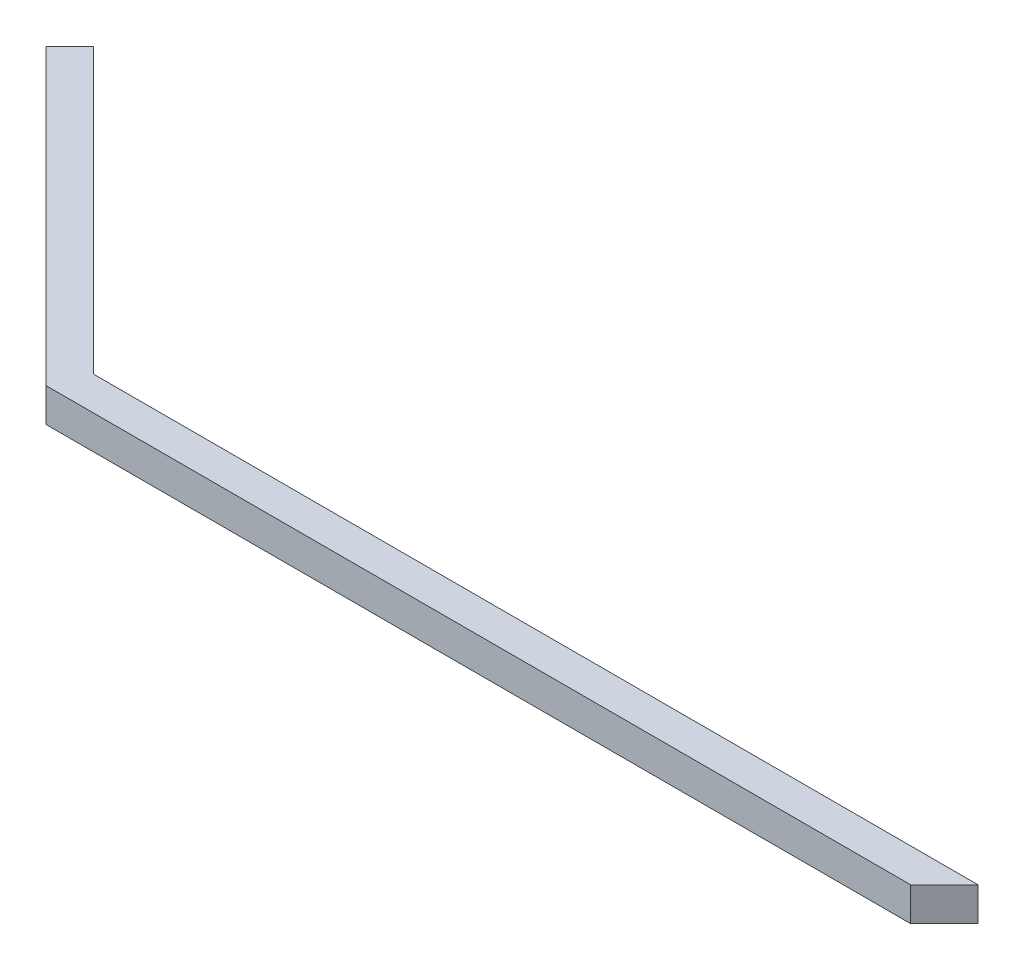
ISO-10303-21;
HEADER;
FILE_DESCRIPTION(('STEP AP214'),'2;1');
FILE_NAME('part.step','',(''),(''),'','','');
FILE_SCHEMA(('AUTOMOTIVE_DESIGN { 1 0 10303 214 1 1 1 1 }'));
ENDSEC;
DATA;
#1=APPLICATION_CONTEXT('core data for automotive mechanical design processes');
#2=APPLICATION_PROTOCOL_DEFINITION('international standard','automotive_design',2000,#1);
#3=PRODUCT_CONTEXT('',#1,'mechanical');
#4=PRODUCT('Part','Part','',(#3));
#5=PRODUCT_RELATED_PRODUCT_CATEGORY('part','',(#4));
#6=PRODUCT_DEFINITION_FORMATION('','',#4);
#7=PRODUCT_DEFINITION_CONTEXT('part definition',#1,'design');
#8=PRODUCT_DEFINITION('design','',#6,#7);
#9=PRODUCT_DEFINITION_SHAPE('','',#8);
#10=(LENGTH_UNIT() NAMED_UNIT(*) SI_UNIT(.MILLI.,.METRE.));
#11=(NAMED_UNIT(*) PLANE_ANGLE_UNIT() SI_UNIT($,.RADIAN.));
#12=(NAMED_UNIT(*) SI_UNIT($,.STERADIAN.) SOLID_ANGLE_UNIT());
#13=UNCERTAINTY_MEASURE_WITH_UNIT(LENGTH_MEASURE(1.E-05),#10,'distance_accuracy_value','');
#14=(GEOMETRIC_REPRESENTATION_CONTEXT(3) GLOBAL_UNCERTAINTY_ASSIGNED_CONTEXT((#13)) GLOBAL_UNIT_ASSIGNED_CONTEXT((#10,
#11,#12)) REPRESENTATION_CONTEXT('',''));
#15=CARTESIAN_POINT('',(0.,0.,0.));
#16=DIRECTION('',(0.,0.,1.));
#17=DIRECTION('',(1.,0.,0.));
#18=AXIS2_PLACEMENT_3D('',#15,#16,#17);
#19=CARTESIAN_POINT('',(-125.738329701443,3.,-56.6276650421873));
#20=DIRECTION('',(0.707106781186548,0.,0.707106781186548));
#21=DIRECTION('',(0.707106781186548,0.,-0.707106781186548));
#22=AXIS2_PLACEMENT_3D('',#19,#20,#21);
#23=PLANE('',#22);
#24=DIRECTION('',(-0.707106781186547,0.,0.707106781186547));
#25=VECTOR('',#24,1.);
#26=CARTESIAN_POINT('',(-125.738329701443,0.,-56.6276650421873));
#27=LINE('',#26,#25);
#28=CARTESIAN_POINT('',(-123.617009357883,0.,-58.748985385747));
#29=VERTEX_POINT('',#28);
#30=CARTESIAN_POINT('',(-125.738329701443,0.,-56.6276650421873));
#31=VERTEX_POINT('',#30);
#32=EDGE_CURVE('E116',#29,#31,#27,.T.);
#33=ORIENTED_EDGE('',*,*,#32,.T.);
#34=DIRECTION('',(0.,-1.,0.));
#35=VECTOR('',#34,1.);
#36=CARTESIAN_POINT('',(-125.738329701443,3.,-56.6276650421873));
#37=LINE('',#36,#35);
#38=CARTESIAN_POINT('',(-125.738329701443,3.,-56.6276650421873));
#39=VERTEX_POINT('',#38);
#40=EDGE_CURVE('E11',#39,#31,#37,.T.);
#41=ORIENTED_EDGE('',*,*,#40,.F.);
#42=DIRECTION('',(-0.707106781186547,0.,0.707106781186547));
#43=VECTOR('',#42,1.);
#44=CARTESIAN_POINT('',(-125.738329701443,3.,-56.6276650421873));
#45=LINE('',#44,#43);
#46=CARTESIAN_POINT('',(-123.617009357883,3.,-58.748985385747));
#47=VERTEX_POINT('',#46);
#48=EDGE_CURVE('E126',#47,#39,#45,.T.);
#49=ORIENTED_EDGE('',*,*,#48,.F.);
#50=DIRECTION('',(0.,-1.,0.));
#51=VECTOR('',#50,1.);
#52=CARTESIAN_POINT('',(-123.617009357883,3.,-58.748985385747));
#53=LINE('',#52,#51);
#54=EDGE_CURVE('E112',#47,#29,#53,.T.);
#55=ORIENTED_EDGE('',*,*,#54,.T.);
#56=EDGE_LOOP('',(#33,#41,#49,#55));
#57=FACE_BOUND('',#56,.T.);
#58=ADVANCED_FACE('F32',(#57),#23,.F.);
#59=CARTESIAN_POINT('',(-125.738329701443,3.,-56.6276650421873));
#60=DIRECTION('',(0.707106781186548,0.,-0.707106781186547));
#61=DIRECTION('',(-0.707106781186547,0.,-0.707106781186548));
#62=AXIS2_PLACEMENT_3D('',#59,#60,#61);
#63=PLANE('',#62);
#64=DIRECTION('',(0.707106781186547,0.,0.707106781186548));
#65=VECTOR('',#64,1.);
#66=CARTESIAN_POINT('',(-125.738329701443,0.,-56.6276650421873));
#67=LINE('',#66,#65);
#68=CARTESIAN_POINT('',(-99.5753787975409,0.,-30.4647141382851));
#69=VERTEX_POINT('',#68);
#70=EDGE_CURVE('E119',#31,#69,#67,.T.);
#71=ORIENTED_EDGE('',*,*,#70,.T.);
#72=DIRECTION('',(0.,-1.,0.));
#73=VECTOR('',#72,1.);
#74=CARTESIAN_POINT('',(-99.5753787975409,3.,-30.4647141382851));
#75=LINE('',#74,#73);
#76=CARTESIAN_POINT('',(-99.5753787975409,3.,-30.4647141382851));
#77=VERTEX_POINT('',#76);
#78=EDGE_CURVE('E40',#77,#69,#75,.T.);
#79=ORIENTED_EDGE('',*,*,#78,.F.);
#80=DIRECTION('',(0.707106781186547,0.,0.707106781186548));
#81=VECTOR('',#80,1.);
#82=CARTESIAN_POINT('',(-125.738329701443,3.,-56.6276650421873));
#83=LINE('',#82,#81);
#84=EDGE_CURVE('E84',#39,#77,#83,.T.);
#85=ORIENTED_EDGE('',*,*,#84,.F.);
#86=ORIENTED_EDGE('',*,*,#40,.T.);
#87=EDGE_LOOP('',(#71,#79,#85,#86));
#88=FACE_BOUND('',#87,.T.);
#89=ADVANCED_FACE('F150',(#88),#63,.F.);
#90=CARTESIAN_POINT('',(-99.5753787975409,3.,-30.4647141382851));
#91=DIRECTION('',(0.,0.,-1.));
#92=DIRECTION('',(-1.,0.,0.));
#93=AXIS2_PLACEMENT_3D('',#90,#91,#92);
#94=PLANE('',#93);
#95=DIRECTION('',(1.,0.,0.));
#96=VECTOR('',#95,1.);
#97=CARTESIAN_POINT('',(-99.5753787975409,0.,-30.4647141382851));
#98=LINE('',#97,#96);
#99=CARTESIAN_POINT('',(-22.5753787975422,0.,-30.4647141382851));
#100=VERTEX_POINT('',#99);
#101=EDGE_CURVE('E121',#69,#100,#98,.T.);
#102=ORIENTED_EDGE('',*,*,#101,.T.);
#103=DIRECTION('',(0.,-1.,0.));
#104=VECTOR('',#103,1.);
#105=CARTESIAN_POINT('',(-22.5753787975422,3.,-30.4647141382851));
#106=LINE('',#105,#104);
#107=CARTESIAN_POINT('',(-22.5753787975422,3.,-30.4647141382851));
#108=VERTEX_POINT('',#107);
#109=EDGE_CURVE('E107',#108,#100,#106,.T.);
#110=ORIENTED_EDGE('',*,*,#109,.F.);
#111=DIRECTION('',(1.,0.,0.));
#112=VECTOR('',#111,1.);
#113=CARTESIAN_POINT('',(-99.5753787975409,3.,-30.4647141382851));
#114=LINE('',#113,#112);
#115=EDGE_CURVE('E97',#77,#108,#114,.T.);
#116=ORIENTED_EDGE('',*,*,#115,.F.);
#117=ORIENTED_EDGE('',*,*,#78,.T.);
#118=EDGE_LOOP('',(#102,#110,#116,#117));
#119=FACE_BOUND('',#118,.T.);
#120=ADVANCED_FACE('F132',(#119),#94,.F.);
#121=CARTESIAN_POINT('',(-19.5753787975423,3.,-33.4647141382851));
#122=DIRECTION('',(-0.70710678118655,0.,-0.707106781186545));
#123=DIRECTION('',(-0.707106781186545,0.,0.70710678118655));
#124=AXIS2_PLACEMENT_3D('',#121,#122,#123);
#125=PLANE('',#124);
#126=DIRECTION('',(0.707106781186545,0.,-0.70710678118655));
#127=VECTOR('',#126,1.);
#128=CARTESIAN_POINT('',(-19.5753787975423,0.,-33.4647141382851));
#129=LINE('',#128,#127);
#130=CARTESIAN_POINT('',(-19.5753787975423,0.,-33.4647141382851));
#131=VERTEX_POINT('',#130);
#132=EDGE_CURVE('E106',#100,#131,#129,.T.);
#133=ORIENTED_EDGE('',*,*,#132,.T.);
#134=DIRECTION('',(0.,-1.,0.));
#135=VECTOR('',#134,1.);
#136=CARTESIAN_POINT('',(-19.5753787975423,3.,-33.4647141382851));
#137=LINE('',#136,#135);
#138=CARTESIAN_POINT('',(-19.5753787975423,3.,-33.4647141382851));
#139=VERTEX_POINT('',#138);
#140=EDGE_CURVE('E103',#139,#131,#137,.T.);
#141=ORIENTED_EDGE('',*,*,#140,.F.);
#142=DIRECTION('',(0.707106781186545,0.,-0.70710678118655));
#143=VECTOR('',#142,1.);
#144=CARTESIAN_POINT('',(-19.5753787975423,3.,-33.4647141382851));
#145=LINE('',#144,#143);
#146=EDGE_CURVE('E91',#108,#139,#145,.T.);
#147=ORIENTED_EDGE('',*,*,#146,.F.);
#148=ORIENTED_EDGE('',*,*,#109,.T.);
#149=EDGE_LOOP('',(#133,#141,#147,#148));
#150=FACE_BOUND('',#149,.T.);
#151=ADVANCED_FACE('F104',(#150),#125,.F.);
#152=CARTESIAN_POINT('',(-98.3327381104216,3.,-33.4647141382851));
#153=DIRECTION('',(0.,0.,1.));
#154=DIRECTION('',(1.,0.,0.));
#155=AXIS2_PLACEMENT_3D('',#152,#153,#154);
#156=PLANE('',#155);
#157=DIRECTION('',(-1.,0.,0.));
#158=VECTOR('',#157,1.);
#159=CARTESIAN_POINT('',(-98.3327381104216,0.,-33.4647141382851));
#160=LINE('',#159,#158);
#161=CARTESIAN_POINT('',(-98.3327381104216,0.,-33.4647141382851));
#162=VERTEX_POINT('',#161);
#163=EDGE_CURVE('E70',#131,#162,#160,.T.);
#164=ORIENTED_EDGE('',*,*,#163,.T.);
#165=DIRECTION('',(0.,-1.,0.));
#166=VECTOR('',#165,1.);
#167=CARTESIAN_POINT('',(-98.3327381104216,3.,-33.4647141382851));
#168=LINE('',#167,#166);
#169=CARTESIAN_POINT('',(-98.3327381104216,3.,-33.4647141382851));
#170=VERTEX_POINT('',#169);
#171=EDGE_CURVE('E108',#170,#162,#168,.T.);
#172=ORIENTED_EDGE('',*,*,#171,.F.);
#173=DIRECTION('',(-1.,0.,0.));
#174=VECTOR('',#173,1.);
#175=CARTESIAN_POINT('',(-22.5753787975423,3.,-33.4647141382851));
#176=LINE('',#175,#174);
#177=EDGE_CURVE('E95',#139,#170,#176,.T.);
#178=ORIENTED_EDGE('',*,*,#177,.F.);
#179=ORIENTED_EDGE('',*,*,#140,.T.);
#180=EDGE_LOOP('',(#164,#172,#178,#179));
#181=FACE_BOUND('',#180,.T.);
#182=ADVANCED_FACE('F110',(#181),#156,.F.);
#183=CARTESIAN_POINT('',(-123.617009357883,3.,-58.748985385747));
#184=DIRECTION('',(-0.707106781186548,0.,0.707106781186547));
#185=DIRECTION('',(0.707106781186547,0.,0.707106781186548));
#186=AXIS2_PLACEMENT_3D('',#183,#184,#185);
#187=PLANE('',#186);
#188=DIRECTION('',(-0.707106781186547,0.,-0.707106781186548));
#189=VECTOR('',#188,1.);
#190=CARTESIAN_POINT('',(-123.617009357883,0.,-58.748985385747));
#191=LINE('',#190,#189);
#192=EDGE_CURVE('E76',#162,#29,#191,.T.);
#193=ORIENTED_EDGE('',*,*,#192,.T.);
#194=ORIENTED_EDGE('',*,*,#54,.F.);
#195=DIRECTION('',(-0.707106781186547,0.,-0.707106781186548));
#196=VECTOR('',#195,1.);
#197=CARTESIAN_POINT('',(-123.617009357883,3.,-58.748985385747));
#198=LINE('',#197,#196);
#199=EDGE_CURVE('E48',#170,#47,#198,.T.);
#200=ORIENTED_EDGE('',*,*,#199,.F.);
#201=ORIENTED_EDGE('',*,*,#171,.T.);
#202=EDGE_LOOP('',(#193,#194,#200,#201));
#203=FACE_BOUND('',#202,.T.);
#204=ADVANCED_FACE('F139',(#203),#187,.F.);
#205=CARTESIAN_POINT('',(0.,3.,0.));
#206=DIRECTION('',(0.,-1.,0.));
#207=DIRECTION('',(0.,0.,-1.));
#208=AXIS2_PLACEMENT_3D('',#205,#206,#207);
#209=PLANE('',#208);
#210=ORIENTED_EDGE('',*,*,#48,.T.);
#211=ORIENTED_EDGE('',*,*,#84,.T.);
#212=ORIENTED_EDGE('',*,*,#115,.T.);
#213=ORIENTED_EDGE('',*,*,#146,.T.);
#214=ORIENTED_EDGE('',*,*,#177,.T.);
#215=ORIENTED_EDGE('',*,*,#199,.T.);
#216=EDGE_LOOP('',(#210,#211,#212,#213,#214,#215));
#217=FACE_BOUND('',#216,.T.);
#218=ADVANCED_FACE('F93',(#217),#209,.F.);
#219=CARTESIAN_POINT('',(0.,0.,0.));
#220=DIRECTION('',(0.,-1.,0.));
#221=DIRECTION('',(0.,0.,-1.));
#222=AXIS2_PLACEMENT_3D('',#219,#220,#221);
#223=PLANE('',#222);
#224=ORIENTED_EDGE('',*,*,#32,.F.);
#225=ORIENTED_EDGE('',*,*,#192,.F.);
#226=ORIENTED_EDGE('',*,*,#163,.F.);
#227=ORIENTED_EDGE('',*,*,#132,.F.);
#228=ORIENTED_EDGE('',*,*,#101,.F.);
#229=ORIENTED_EDGE('',*,*,#70,.F.);
#230=EDGE_LOOP('',(#224,#225,#226,#227,#228,#229));
#231=FACE_BOUND('',#230,.T.);
#232=ADVANCED_FACE('F135',(#231),#223,.T.);
#233=CLOSED_SHELL('',(#58,#89,#120,#151,#182,#204,#218,#232));
#234=MANIFOLD_SOLID_BREP('B2',#233);
#235=ADVANCED_BREP_SHAPE_REPRESENTATION('',(#18,#234),#14);
#236=SHAPE_DEFINITION_REPRESENTATION(#9,#235);
ENDSEC;
END-ISO-10303-21;
